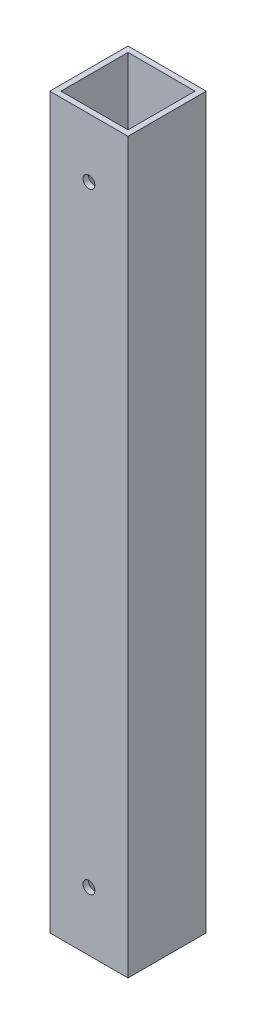
ISO-10303-21;
HEADER;
FILE_DESCRIPTION(('STEP AP214'),'2;1');
FILE_NAME('part.step','',(''),(''),'','','');
FILE_SCHEMA(('AUTOMOTIVE_DESIGN { 1 0 10303 214 1 1 1 1 }'));
ENDSEC;
DATA;
#1=APPLICATION_CONTEXT('core data for automotive mechanical design processes');
#2=APPLICATION_PROTOCOL_DEFINITION('international standard','automotive_design',2000,#1);
#3=PRODUCT_CONTEXT('',#1,'mechanical');
#4=PRODUCT('Part','Part','',(#3));
#5=PRODUCT_RELATED_PRODUCT_CATEGORY('part','',(#4));
#6=PRODUCT_DEFINITION_FORMATION('','',#4);
#7=PRODUCT_DEFINITION_CONTEXT('part definition',#1,'design');
#8=PRODUCT_DEFINITION('design','',#6,#7);
#9=PRODUCT_DEFINITION_SHAPE('','',#8);
#10=(LENGTH_UNIT() NAMED_UNIT(*) SI_UNIT(.MILLI.,.METRE.));
#11=(NAMED_UNIT(*) PLANE_ANGLE_UNIT() SI_UNIT($,.RADIAN.));
#12=(NAMED_UNIT(*) SI_UNIT($,.STERADIAN.) SOLID_ANGLE_UNIT());
#13=UNCERTAINTY_MEASURE_WITH_UNIT(LENGTH_MEASURE(1.E-05),#10,'distance_accuracy_value','');
#14=(GEOMETRIC_REPRESENTATION_CONTEXT(3) GLOBAL_UNCERTAINTY_ASSIGNED_CONTEXT((#13)) GLOBAL_UNIT_ASSIGNED_CONTEXT((#10,
#11,#12)) REPRESENTATION_CONTEXT('',''));
#15=CARTESIAN_POINT('',(0.,0.,0.));
#16=DIRECTION('',(0.,0.,1.));
#17=DIRECTION('',(1.,0.,0.));
#18=AXIS2_PLACEMENT_3D('',#15,#16,#17);
#19=CARTESIAN_POINT('',(22.2250000000001,-207.16875,22.225));
#20=DIRECTION('',(1.,0.,0.));
#21=DIRECTION('',(0.,0.,-1.));
#22=AXIS2_PLACEMENT_3D('',#19,#20,#21);
#23=PLANE('',#22);
#24=DIRECTION('',(0.,1.,0.));
#25=VECTOR('',#24,1.);
#26=CARTESIAN_POINT('',(22.2250000000001,-207.16875,-22.225));
#27=LINE('',#26,#25);
#28=CARTESIAN_POINT('',(22.2250000000001,-207.16875,-22.225));
#29=VERTEX_POINT('',#28);
#30=CARTESIAN_POINT('',(22.2250000000001,207.16875,-22.225));
#31=VERTEX_POINT('',#30);
#32=EDGE_CURVE('E194',#29,#31,#27,.T.);
#33=ORIENTED_EDGE('',*,*,#32,.T.);
#34=DIRECTION('',(0.,0.,-1.));
#35=VECTOR('',#34,1.);
#36=CARTESIAN_POINT('',(22.2250000000001,207.16875,22.225));
#37=LINE('',#36,#35);
#38=CARTESIAN_POINT('',(22.2250000000001,207.16875,22.225));
#39=VERTEX_POINT('',#38);
#40=EDGE_CURVE('E147',#39,#31,#37,.T.);
#41=ORIENTED_EDGE('',*,*,#40,.F.);
#42=DIRECTION('',(0.,1.,0.));
#43=VECTOR('',#42,1.);
#44=CARTESIAN_POINT('',(22.2250000000001,-207.16875,22.225));
#45=LINE('',#44,#43);
#46=CARTESIAN_POINT('',(22.2250000000001,-207.16875,22.225));
#47=VERTEX_POINT('',#46);
#48=EDGE_CURVE('E11',#47,#39,#45,.T.);
#49=ORIENTED_EDGE('',*,*,#48,.F.);
#50=DIRECTION('',(0.,0.,-1.));
#51=VECTOR('',#50,1.);
#52=CARTESIAN_POINT('',(22.2250000000001,-207.16875,22.225));
#53=LINE('',#52,#51);
#54=EDGE_CURVE('E175',#47,#29,#53,.T.);
#55=ORIENTED_EDGE('',*,*,#54,.T.);
#56=EDGE_LOOP('',(#33,#41,#49,#55));
#57=FACE_BOUND('',#56,.T.);
#58=ADVANCED_FACE('F43',(#57),#23,.T.);
#59=CARTESIAN_POINT('',(-22.2249999999999,-207.16875,22.225));
#60=DIRECTION('',(0.,0.,1.));
#61=DIRECTION('',(1.,0.,0.));
#62=AXIS2_PLACEMENT_3D('',#59,#60,#61);
#63=PLANE('',#62);
#64=CARTESIAN_POINT('',(0.,173.609,22.225));
#65=DIRECTION('',(0.,0.,1.));
#66=DIRECTION('',(1.,0.,0.));
#67=AXIS2_PLACEMENT_3D('',#64,#65,#66);
#68=CIRCLE('',#67,3.37350099999999);
#69=CARTESIAN_POINT('',(3.37350099999999,173.609,22.225));
#70=VERTEX_POINT('',#69);
#71=EDGE_CURVE('E230',#70,#70,#68,.T.);
#72=ORIENTED_EDGE('',*,*,#71,.F.);
#73=EDGE_LOOP('',(#72));
#74=FACE_BOUND('',#73,.T.);
#75=CARTESIAN_POINT('',(0.,-173.609,22.225));
#76=DIRECTION('',(0.,0.,1.));
#77=DIRECTION('',(1.,0.,0.));
#78=AXIS2_PLACEMENT_3D('',#75,#76,#77);
#79=CIRCLE('',#78,3.37350099999999);
#80=CARTESIAN_POINT('',(3.37350099999999,-173.609,22.225));
#81=VERTEX_POINT('',#80);
#82=EDGE_CURVE('E213',#81,#81,#79,.T.);
#83=ORIENTED_EDGE('',*,*,#82,.F.);
#84=EDGE_LOOP('',(#83));
#85=FACE_BOUND('',#84,.T.);
#86=ORIENTED_EDGE('',*,*,#48,.T.);
#87=DIRECTION('',(1.,0.,0.));
#88=VECTOR('',#87,1.);
#89=CARTESIAN_POINT('',(-22.2249999999999,207.16875,22.225));
#90=LINE('',#89,#88);
#91=CARTESIAN_POINT('',(-22.2249999999999,207.16875,22.225));
#92=VERTEX_POINT('',#91);
#93=EDGE_CURVE('E159',#92,#39,#90,.T.);
#94=ORIENTED_EDGE('',*,*,#93,.F.);
#95=DIRECTION('',(0.,1.,0.));
#96=VECTOR('',#95,1.);
#97=CARTESIAN_POINT('',(-22.2249999999999,-207.16875,22.225));
#98=LINE('',#97,#96);
#99=CARTESIAN_POINT('',(-22.2249999999999,-207.16875,22.225));
#100=VERTEX_POINT('',#99);
#101=EDGE_CURVE('E52',#100,#92,#98,.T.);
#102=ORIENTED_EDGE('',*,*,#101,.F.);
#103=DIRECTION('',(1.,0.,0.));
#104=VECTOR('',#103,1.);
#105=CARTESIAN_POINT('',(-22.2249999999999,-207.16875,22.225));
#106=LINE('',#105,#104);
#107=EDGE_CURVE('E191',#100,#47,#106,.T.);
#108=ORIENTED_EDGE('',*,*,#107,.T.);
#109=EDGE_LOOP('',(#86,#94,#102,#108));
#110=FACE_BOUND('',#109,.T.);
#111=ADVANCED_FACE('F239',(#74,#85,#110),#63,.T.);
#112=CARTESIAN_POINT('',(-22.2249999999999,-207.16875,22.225));
#113=DIRECTION('',(-1.,0.,0.));
#114=DIRECTION('',(0.,0.,1.));
#115=AXIS2_PLACEMENT_3D('',#112,#113,#114);
#116=PLANE('',#115);
#117=ORIENTED_EDGE('',*,*,#101,.T.);
#118=DIRECTION('',(0.,0.,1.));
#119=VECTOR('',#118,1.);
#120=CARTESIAN_POINT('',(-22.2249999999999,207.16875,22.225));
#121=LINE('',#120,#119);
#122=CARTESIAN_POINT('',(-22.2249999999999,207.16875,-22.225));
#123=VERTEX_POINT('',#122);
#124=EDGE_CURVE('E155',#123,#92,#121,.T.);
#125=ORIENTED_EDGE('',*,*,#124,.F.);
#126=DIRECTION('',(0.,1.,0.));
#127=VECTOR('',#126,1.);
#128=CARTESIAN_POINT('',(-22.2249999999999,-207.16875,-22.225));
#129=LINE('',#128,#127);
#130=CARTESIAN_POINT('',(-22.2249999999999,-207.16875,-22.225));
#131=VERTEX_POINT('',#130);
#132=EDGE_CURVE('E198',#131,#123,#129,.T.);
#133=ORIENTED_EDGE('',*,*,#132,.F.);
#134=DIRECTION('',(0.,0.,1.));
#135=VECTOR('',#134,1.);
#136=CARTESIAN_POINT('',(-22.2249999999999,-207.16875,22.225));
#137=LINE('',#136,#135);
#138=EDGE_CURVE('E187',#131,#100,#137,.T.);
#139=ORIENTED_EDGE('',*,*,#138,.T.);
#140=EDGE_LOOP('',(#117,#125,#133,#139));
#141=FACE_BOUND('',#140,.T.);
#142=ADVANCED_FACE('F242',(#141),#116,.T.);
#143=CARTESIAN_POINT('',(-22.2249999999999,-207.16875,-22.225));
#144=DIRECTION('',(0.,0.,-1.));
#145=DIRECTION('',(-1.,0.,0.));
#146=AXIS2_PLACEMENT_3D('',#143,#144,#145);
#147=PLANE('',#146);
#148=CARTESIAN_POINT('',(0.,173.609,-22.225));
#149=DIRECTION('',(0.,0.,1.));
#150=DIRECTION('',(1.,0.,0.));
#151=AXIS2_PLACEMENT_3D('',#148,#149,#150);
#152=CIRCLE('',#151,3.37350099999999);
#153=CARTESIAN_POINT('',(3.37350099999999,173.609,-22.225));
#154=VERTEX_POINT('',#153);
#155=EDGE_CURVE('E226',#154,#154,#152,.T.);
#156=ORIENTED_EDGE('',*,*,#155,.T.);
#157=EDGE_LOOP('',(#156));
#158=FACE_BOUND('',#157,.T.);
#159=CARTESIAN_POINT('',(0.,-173.609,-22.225));
#160=DIRECTION('',(0.,0.,1.));
#161=DIRECTION('',(1.,0.,0.));
#162=AXIS2_PLACEMENT_3D('',#159,#160,#161);
#163=CIRCLE('',#162,3.37350099999999);
#164=CARTESIAN_POINT('',(3.37350099999999,-173.609,-22.225));
#165=VERTEX_POINT('',#164);
#166=EDGE_CURVE('E205',#165,#165,#163,.T.);
#167=ORIENTED_EDGE('',*,*,#166,.T.);
#168=EDGE_LOOP('',(#167));
#169=FACE_BOUND('',#168,.T.);
#170=ORIENTED_EDGE('',*,*,#132,.T.);
#171=DIRECTION('',(-1.,0.,0.));
#172=VECTOR('',#171,1.);
#173=CARTESIAN_POINT('',(-22.2249999999999,207.16875,-22.225));
#174=LINE('',#173,#172);
#175=EDGE_CURVE('E151',#31,#123,#174,.T.);
#176=ORIENTED_EDGE('',*,*,#175,.F.);
#177=ORIENTED_EDGE('',*,*,#32,.F.);
#178=DIRECTION('',(-1.,0.,0.));
#179=VECTOR('',#178,1.);
#180=CARTESIAN_POINT('',(-22.2249999999999,-207.16875,-22.225));
#181=LINE('',#180,#179);
#182=EDGE_CURVE('E183',#29,#131,#181,.T.);
#183=ORIENTED_EDGE('',*,*,#182,.T.);
#184=EDGE_LOOP('',(#170,#176,#177,#183));
#185=FACE_BOUND('',#184,.T.);
#186=ADVANCED_FACE('F253',(#158,#169,#185),#147,.T.);
#187=CARTESIAN_POINT('',(0.,-207.16875,0.));
#188=DIRECTION('',(0.,-1.,0.));
#189=DIRECTION('',(0.,0.,-1.));
#190=AXIS2_PLACEMENT_3D('',#187,#188,#189);
#191=PLANE('',#190);
#192=DIRECTION('',(0.,0.,-1.));
#193=VECTOR('',#192,1.);
#194=CARTESIAN_POINT('',(19.05,-207.16875,19.05));
#195=LINE('',#194,#193);
#196=CARTESIAN_POINT('',(19.05,-207.16875,19.05));
#197=VERTEX_POINT('',#196);
#198=CARTESIAN_POINT('',(19.05,-207.16875,-19.05));
#199=VERTEX_POINT('',#198);
#200=EDGE_CURVE('E163',#197,#199,#195,.T.);
#201=ORIENTED_EDGE('',*,*,#200,.T.);
#202=DIRECTION('',(-1.,0.,0.));
#203=VECTOR('',#202,1.);
#204=CARTESIAN_POINT('',(-19.05,-207.16875,-19.05));
#205=LINE('',#204,#203);
#206=CARTESIAN_POINT('',(-19.05,-207.16875,-19.05));
#207=VERTEX_POINT('',#206);
#208=EDGE_CURVE('E116',#199,#207,#205,.T.);
#209=ORIENTED_EDGE('',*,*,#208,.T.);
#210=DIRECTION('',(0.,0.,1.));
#211=VECTOR('',#210,1.);
#212=CARTESIAN_POINT('',(-19.05,-207.16875,19.05));
#213=LINE('',#212,#211);
#214=CARTESIAN_POINT('',(-19.05,-207.16875,19.05));
#215=VERTEX_POINT('',#214);
#216=EDGE_CURVE('E60',#207,#215,#213,.T.);
#217=ORIENTED_EDGE('',*,*,#216,.T.);
#218=DIRECTION('',(1.,0.,0.));
#219=VECTOR('',#218,1.);
#220=CARTESIAN_POINT('',(-19.05,-207.16875,19.05));
#221=LINE('',#220,#219);
#222=EDGE_CURVE('E122',#215,#197,#221,.T.);
#223=ORIENTED_EDGE('',*,*,#222,.T.);
#224=EDGE_LOOP('',(#201,#209,#217,#223));
#225=FACE_BOUND('',#224,.T.);
#226=ORIENTED_EDGE('',*,*,#54,.F.);
#227=ORIENTED_EDGE('',*,*,#107,.F.);
#228=ORIENTED_EDGE('',*,*,#138,.F.);
#229=ORIENTED_EDGE('',*,*,#182,.F.);
#230=EDGE_LOOP('',(#226,#227,#228,#229));
#231=FACE_BOUND('',#230,.T.);
#232=ADVANCED_FACE('F257',(#225,#231),#191,.T.);
#233=CARTESIAN_POINT('',(19.05,-207.16875,19.05));
#234=DIRECTION('',(1.,0.,0.));
#235=DIRECTION('',(0.,0.,-1.));
#236=AXIS2_PLACEMENT_3D('',#233,#234,#235);
#237=PLANE('',#236);
#238=DIRECTION('',(0.,1.,0.));
#239=VECTOR('',#238,1.);
#240=CARTESIAN_POINT('',(19.05,-207.16875,19.05));
#241=LINE('',#240,#239);
#242=CARTESIAN_POINT('',(19.05,207.16875,19.05));
#243=VERTEX_POINT('',#242);
#244=EDGE_CURVE('E127',#197,#243,#241,.T.);
#245=ORIENTED_EDGE('',*,*,#244,.T.);
#246=DIRECTION('',(0.,0.,-1.));
#247=VECTOR('',#246,1.);
#248=CARTESIAN_POINT('',(19.05,207.16875,19.05));
#249=LINE('',#248,#247);
#250=CARTESIAN_POINT('',(19.05,207.16875,-19.05));
#251=VERTEX_POINT('',#250);
#252=EDGE_CURVE('E125',#243,#251,#249,.T.);
#253=ORIENTED_EDGE('',*,*,#252,.T.);
#254=DIRECTION('',(0.,1.,0.));
#255=VECTOR('',#254,1.);
#256=CARTESIAN_POINT('',(19.05,-207.16875,-19.05));
#257=LINE('',#256,#255);
#258=EDGE_CURVE('E109',#199,#251,#257,.T.);
#259=ORIENTED_EDGE('',*,*,#258,.F.);
#260=ORIENTED_EDGE('',*,*,#200,.F.);
#261=EDGE_LOOP('',(#245,#253,#259,#260));
#262=FACE_BOUND('',#261,.T.);
#263=ADVANCED_FACE('F126',(#262),#237,.F.);
#264=CARTESIAN_POINT('',(-19.05,-207.16875,19.05));
#265=DIRECTION('',(0.,0.,1.));
#266=DIRECTION('',(1.,0.,0.));
#267=AXIS2_PLACEMENT_3D('',#264,#265,#266);
#268=PLANE('',#267);
#269=CARTESIAN_POINT('',(0.,173.609,19.05));
#270=DIRECTION('',(0.,0.,1.));
#271=DIRECTION('',(1.,0.,0.));
#272=AXIS2_PLACEMENT_3D('',#269,#270,#271);
#273=CIRCLE('',#272,3.37350099999999);
#274=CARTESIAN_POINT('',(3.37350099999999,173.609,19.05));
#275=VERTEX_POINT('',#274);
#276=EDGE_CURVE('E220',#275,#275,#273,.T.);
#277=ORIENTED_EDGE('',*,*,#276,.T.);
#278=EDGE_LOOP('',(#277));
#279=FACE_BOUND('',#278,.T.);
#280=CARTESIAN_POINT('',(0.,-173.609,19.05));
#281=DIRECTION('',(0.,0.,1.));
#282=DIRECTION('',(1.,0.,0.));
#283=AXIS2_PLACEMENT_3D('',#280,#281,#282);
#284=CIRCLE('',#283,3.37350099999999);
#285=CARTESIAN_POINT('',(3.37350099999999,-173.609,19.05));
#286=VERTEX_POINT('',#285);
#287=EDGE_CURVE('E132',#286,#286,#284,.T.);
#288=ORIENTED_EDGE('',*,*,#287,.T.);
#289=EDGE_LOOP('',(#288));
#290=FACE_BOUND('',#289,.T.);
#291=DIRECTION('',(0.,1.,0.));
#292=VECTOR('',#291,1.);
#293=CARTESIAN_POINT('',(-19.05,-207.16875,19.05));
#294=LINE('',#293,#292);
#295=CARTESIAN_POINT('',(-19.05,207.16875,19.05));
#296=VERTEX_POINT('',#295);
#297=EDGE_CURVE('E176',#215,#296,#294,.T.);
#298=ORIENTED_EDGE('',*,*,#297,.T.);
#299=DIRECTION('',(1.,0.,0.));
#300=VECTOR('',#299,1.);
#301=CARTESIAN_POINT('',(-19.05,207.16875,19.05));
#302=LINE('',#301,#300);
#303=EDGE_CURVE('E141',#296,#243,#302,.T.);
#304=ORIENTED_EDGE('',*,*,#303,.T.);
#305=ORIENTED_EDGE('',*,*,#244,.F.);
#306=ORIENTED_EDGE('',*,*,#222,.F.);
#307=EDGE_LOOP('',(#298,#304,#305,#306));
#308=FACE_BOUND('',#307,.T.);
#309=ADVANCED_FACE('F265',(#279,#290,#308),#268,.F.);
#310=CARTESIAN_POINT('',(-19.05,-207.16875,19.05));
#311=DIRECTION('',(-1.,0.,0.));
#312=DIRECTION('',(0.,0.,1.));
#313=AXIS2_PLACEMENT_3D('',#310,#311,#312);
#314=PLANE('',#313);
#315=DIRECTION('',(0.,1.,0.));
#316=VECTOR('',#315,1.);
#317=CARTESIAN_POINT('',(-19.05,-207.16875,-19.05));
#318=LINE('',#317,#316);
#319=CARTESIAN_POINT('',(-19.05,207.16875,-19.05));
#320=VERTEX_POINT('',#319);
#321=EDGE_CURVE('E121',#207,#320,#318,.T.);
#322=ORIENTED_EDGE('',*,*,#321,.T.);
#323=DIRECTION('',(0.,0.,1.));
#324=VECTOR('',#323,1.);
#325=CARTESIAN_POINT('',(-19.05,207.16875,19.05));
#326=LINE('',#325,#324);
#327=EDGE_CURVE('E136',#320,#296,#326,.T.);
#328=ORIENTED_EDGE('',*,*,#327,.T.);
#329=ORIENTED_EDGE('',*,*,#297,.F.);
#330=ORIENTED_EDGE('',*,*,#216,.F.);
#331=EDGE_LOOP('',(#322,#328,#329,#330));
#332=FACE_BOUND('',#331,.T.);
#333=ADVANCED_FACE('F304',(#332),#314,.F.);
#334=CARTESIAN_POINT('',(-19.05,-207.16875,-19.05));
#335=DIRECTION('',(0.,0.,-1.));
#336=DIRECTION('',(-1.,0.,0.));
#337=AXIS2_PLACEMENT_3D('',#334,#335,#336);
#338=PLANE('',#337);
#339=CARTESIAN_POINT('',(0.,173.609,-19.05));
#340=DIRECTION('',(0.,0.,-1.));
#341=DIRECTION('',(-1.,0.,0.));
#342=AXIS2_PLACEMENT_3D('',#339,#340,#341);
#343=CIRCLE('',#342,3.37350099999999);
#344=CARTESIAN_POINT('',(-3.37350099999999,173.609,-19.05));
#345=VERTEX_POINT('',#344);
#346=EDGE_CURVE('E46',#345,#345,#343,.T.);
#347=ORIENTED_EDGE('',*,*,#346,.T.);
#348=EDGE_LOOP('',(#347));
#349=FACE_BOUND('',#348,.T.);
#350=CARTESIAN_POINT('',(0.,-173.609,-19.05));
#351=DIRECTION('',(0.,0.,-1.));
#352=DIRECTION('',(-1.,0.,0.));
#353=AXIS2_PLACEMENT_3D('',#350,#351,#352);
#354=CIRCLE('',#353,3.37350099999999);
#355=CARTESIAN_POINT('',(-3.37350099999999,-173.609,-19.05));
#356=VERTEX_POINT('',#355);
#357=EDGE_CURVE('E202',#356,#356,#354,.T.);
#358=ORIENTED_EDGE('',*,*,#357,.T.);
#359=EDGE_LOOP('',(#358));
#360=FACE_BOUND('',#359,.T.);
#361=ORIENTED_EDGE('',*,*,#258,.T.);
#362=DIRECTION('',(-1.,0.,0.));
#363=VECTOR('',#362,1.);
#364=CARTESIAN_POINT('',(-19.05,207.16875,-19.05));
#365=LINE('',#364,#363);
#366=EDGE_CURVE('E113',#251,#320,#365,.T.);
#367=ORIENTED_EDGE('',*,*,#366,.T.);
#368=ORIENTED_EDGE('',*,*,#321,.F.);
#369=ORIENTED_EDGE('',*,*,#208,.F.);
#370=EDGE_LOOP('',(#361,#367,#368,#369));
#371=FACE_BOUND('',#370,.T.);
#372=ADVANCED_FACE('F111',(#349,#360,#371),#338,.F.);
#373=CARTESIAN_POINT('',(0.,207.16875,0.));
#374=DIRECTION('',(0.,-1.,0.));
#375=DIRECTION('',(0.,0.,-1.));
#376=AXIS2_PLACEMENT_3D('',#373,#374,#375);
#377=PLANE('',#376);
#378=ORIENTED_EDGE('',*,*,#40,.T.);
#379=ORIENTED_EDGE('',*,*,#175,.T.);
#380=ORIENTED_EDGE('',*,*,#124,.T.);
#381=ORIENTED_EDGE('',*,*,#93,.T.);
#382=EDGE_LOOP('',(#378,#379,#380,#381));
#383=FACE_BOUND('',#382,.T.);
#384=ORIENTED_EDGE('',*,*,#252,.F.);
#385=ORIENTED_EDGE('',*,*,#303,.F.);
#386=ORIENTED_EDGE('',*,*,#327,.F.);
#387=ORIENTED_EDGE('',*,*,#366,.F.);
#388=EDGE_LOOP('',(#384,#385,#386,#387));
#389=FACE_BOUND('',#388,.T.);
#390=ADVANCED_FACE('F134',(#383,#389),#377,.F.);
#391=CARTESIAN_POINT('',(0.,-173.609,22.225));
#392=DIRECTION('',(0.,0.,1.));
#393=DIRECTION('',(1.,0.,0.));
#394=AXIS2_PLACEMENT_3D('',#391,#392,#393);
#395=CYLINDRICAL_SURFACE('',#394,3.37350099999999);
#396=ORIENTED_EDGE('',*,*,#166,.F.);
#397=EDGE_LOOP('',(#396));
#398=FACE_BOUND('',#397,.T.);
#399=ORIENTED_EDGE('',*,*,#357,.F.);
#400=EDGE_LOOP('',(#399));
#401=FACE_BOUND('',#400,.T.);
#402=ADVANCED_FACE('F331',(#398,#401),#395,.F.);
#403=ORIENTED_EDGE('',*,*,#82,.T.);
#404=EDGE_LOOP('',(#403));
#405=FACE_BOUND('',#404,.T.);
#406=ORIENTED_EDGE('',*,*,#287,.F.);
#407=EDGE_LOOP('',(#406));
#408=FACE_BOUND('',#407,.T.);
#409=ADVANCED_FACE('F340',(#405,#408),#395,.F.);
#410=CARTESIAN_POINT('',(0.,173.609,22.225));
#411=DIRECTION('',(0.,0.,1.));
#412=DIRECTION('',(1.,0.,0.));
#413=AXIS2_PLACEMENT_3D('',#410,#411,#412);
#414=CYLINDRICAL_SURFACE('',#413,3.37350099999999);
#415=ORIENTED_EDGE('',*,*,#155,.F.);
#416=EDGE_LOOP('',(#415));
#417=FACE_BOUND('',#416,.T.);
#418=ORIENTED_EDGE('',*,*,#346,.F.);
#419=EDGE_LOOP('',(#418));
#420=FACE_BOUND('',#419,.T.);
#421=ADVANCED_FACE('F350',(#417,#420),#414,.F.);
#422=ORIENTED_EDGE('',*,*,#71,.T.);
#423=EDGE_LOOP('',(#422));
#424=FACE_BOUND('',#423,.T.);
#425=ORIENTED_EDGE('',*,*,#276,.F.);
#426=EDGE_LOOP('',(#425));
#427=FACE_BOUND('',#426,.T.);
#428=ADVANCED_FACE('F236',(#424,#427),#414,.F.);
#429=CLOSED_SHELL('',(#58,#111,#142,#186,#232,#263,#309,#333,#372,#390,#402,#409,#421,#428));
#430=MANIFOLD_SOLID_BREP('B2',#429);
#431=ADVANCED_BREP_SHAPE_REPRESENTATION('',(#18,#430),#14);
#432=SHAPE_DEFINITION_REPRESENTATION(#9,#431);
ENDSEC;
END-ISO-10303-21;
